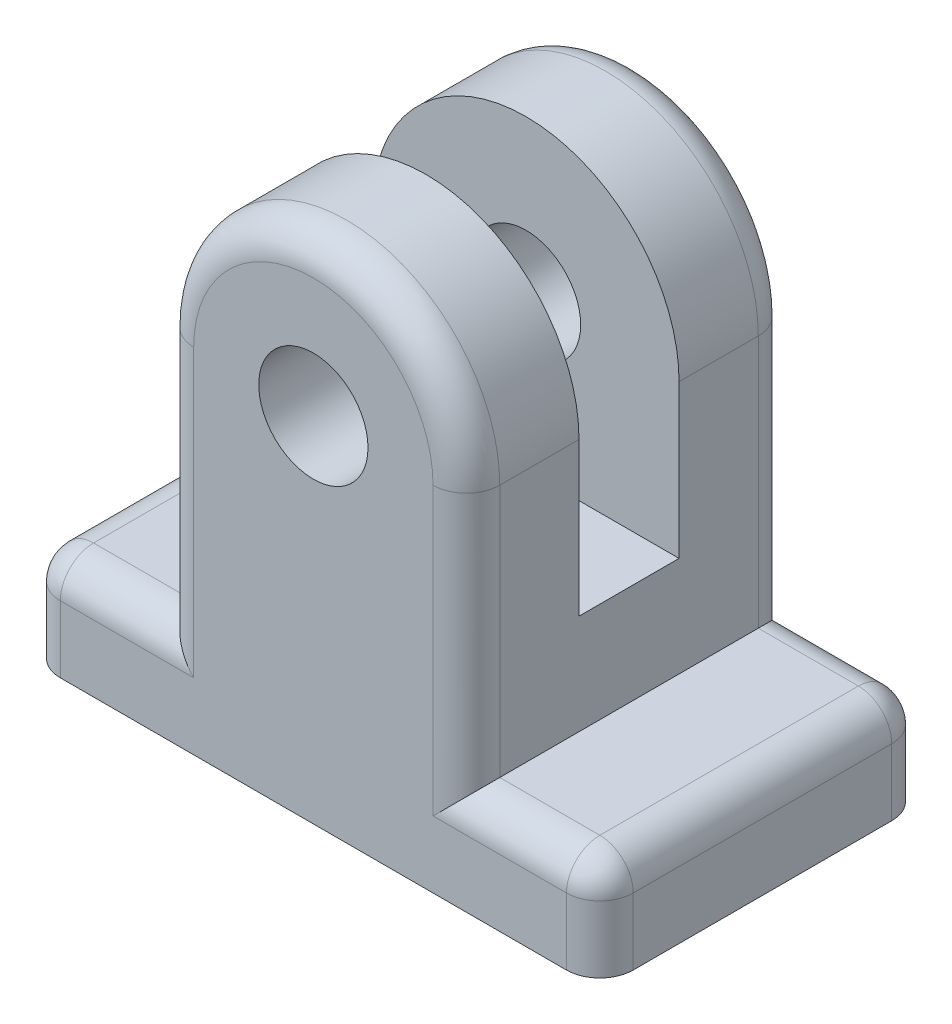
ISO-10303-21;
HEADER;
FILE_DESCRIPTION(('STEP AP214'),'2;1');
FILE_NAME('part.step','',(''),(''),'','','');
FILE_SCHEMA(('AUTOMOTIVE_DESIGN { 1 0 10303 214 1 1 1 1 }'));
ENDSEC;
DATA;
#1=APPLICATION_CONTEXT('core data for automotive mechanical design processes');
#2=APPLICATION_PROTOCOL_DEFINITION('international standard','automotive_design',2000,#1);
#3=PRODUCT_CONTEXT('',#1,'mechanical');
#4=PRODUCT('Part','Part','',(#3));
#5=PRODUCT_RELATED_PRODUCT_CATEGORY('part','',(#4));
#6=PRODUCT_DEFINITION_FORMATION('','',#4);
#7=PRODUCT_DEFINITION_CONTEXT('part definition',#1,'design');
#8=PRODUCT_DEFINITION('design','',#6,#7);
#9=PRODUCT_DEFINITION_SHAPE('','',#8);
#10=(LENGTH_UNIT() NAMED_UNIT(*) SI_UNIT(.MILLI.,.METRE.));
#11=(NAMED_UNIT(*) PLANE_ANGLE_UNIT() SI_UNIT($,.RADIAN.));
#12=(NAMED_UNIT(*) SI_UNIT($,.STERADIAN.) SOLID_ANGLE_UNIT());
#13=UNCERTAINTY_MEASURE_WITH_UNIT(LENGTH_MEASURE(1.E-05),#10,'distance_accuracy_value','');
#14=(GEOMETRIC_REPRESENTATION_CONTEXT(3) GLOBAL_UNCERTAINTY_ASSIGNED_CONTEXT((#13)) GLOBAL_UNIT_ASSIGNED_CONTEXT((#10,
#11,#12)) REPRESENTATION_CONTEXT('',''));
#15=CARTESIAN_POINT('',(0.,0.,0.));
#16=DIRECTION('',(0.,0.,1.));
#17=DIRECTION('',(1.,0.,0.));
#18=AXIS2_PLACEMENT_3D('',#15,#16,#17);
#19=CARTESIAN_POINT('',(0.,0.,4.875));
#20=DIRECTION('',(0.,0.,-1.));
#21=DIRECTION('',(-1.,0.,0.));
#22=AXIS2_PLACEMENT_3D('',#19,#20,#21);
#23=CYLINDRICAL_SURFACE('',#22,4.5875);
#24=DIRECTION('',(0.,0.,-1.));
#25=VECTOR('',#24,1.);
#26=CARTESIAN_POINT('',(4.5875,0.,4.875));
#27=LINE('',#26,#25);
#28=CARTESIAN_POINT('',(4.5875,0.,-1.5));
#29=VERTEX_POINT('',#28);
#30=CARTESIAN_POINT('',(4.5875,0.,-3.875));
#31=VERTEX_POINT('',#30);
#32=EDGE_CURVE('E380',#29,#31,#27,.T.);
#33=ORIENTED_EDGE('',*,*,#32,.T.);
#34=CARTESIAN_POINT('',(0.,0.,-3.875));
#35=DIRECTION('',(0.,0.,1.));
#36=DIRECTION('',(1.,0.,0.));
#37=AXIS2_PLACEMENT_3D('',#34,#35,#36);
#38=CIRCLE('',#37,4.5875);
#39=CARTESIAN_POINT('',(-4.5875,0.,-3.875));
#40=VERTEX_POINT('',#39);
#41=EDGE_CURVE('E207',#31,#40,#38,.T.);
#42=ORIENTED_EDGE('',*,*,#41,.T.);
#43=DIRECTION('',(0.,0.,-1.));
#44=VECTOR('',#43,1.);
#45=CARTESIAN_POINT('',(-4.5875,0.,4.875));
#46=LINE('',#45,#44);
#47=CARTESIAN_POINT('',(-4.5875,0.,-1.5));
#48=VERTEX_POINT('',#47);
#49=EDGE_CURVE('E200',#48,#40,#46,.T.);
#50=ORIENTED_EDGE('',*,*,#49,.F.);
#51=CARTESIAN_POINT('',(0.,0.,-1.5));
#52=DIRECTION('',(0.,0.,1.));
#53=DIRECTION('',(1.,0.,0.));
#54=AXIS2_PLACEMENT_3D('',#51,#52,#53);
#55=CIRCLE('',#54,4.5875);
#56=EDGE_CURVE('E182',#29,#48,#55,.T.);
#57=ORIENTED_EDGE('',*,*,#56,.F.);
#58=EDGE_LOOP('',(#33,#42,#50,#57));
#59=FACE_BOUND('',#58,.T.);
#60=ADVANCED_FACE('F34',(#59),#23,.T.);
#61=CARTESIAN_POINT('',(-4.5875,0.,4.875));
#62=DIRECTION('',(1.,0.,0.));
#63=DIRECTION('',(0.,1.,0.));
#64=AXIS2_PLACEMENT_3D('',#61,#62,#63);
#65=PLANE('',#64);
#66=ORIENTED_EDGE('',*,*,#49,.T.);
#67=DIRECTION('',(0.,-1.,0.));
#68=VECTOR('',#67,1.);
#69=CARTESIAN_POINT('',(-4.5875,0.,-3.875));
#70=LINE('',#69,#68);
#71=CARTESIAN_POINT('',(-4.5875,-7.5875,-3.875));
#72=VERTEX_POINT('',#71);
#73=EDGE_CURVE('E218',#40,#72,#70,.T.);
#74=ORIENTED_EDGE('',*,*,#73,.T.);
#75=DIRECTION('',(0.,0.,-1.));
#76=VECTOR('',#75,1.);
#77=CARTESIAN_POINT('',(-4.5875,-7.5875,4.875));
#78=LINE('',#77,#76);
#79=CARTESIAN_POINT('',(-4.5875,-7.5875,3.875));
#80=VERTEX_POINT('',#79);
#81=EDGE_CURVE('E209',#80,#72,#78,.T.);
#82=ORIENTED_EDGE('',*,*,#81,.F.);
#83=DIRECTION('',(0.,-1.,0.));
#84=VECTOR('',#83,1.);
#85=CARTESIAN_POINT('',(-4.5875,0.,3.875));
#86=LINE('',#85,#84);
#87=CARTESIAN_POINT('',(-4.5875,0.,3.875));
#88=VERTEX_POINT('',#87);
#89=EDGE_CURVE('E211',#80,#88,#86,.F.);
#90=ORIENTED_EDGE('',*,*,#89,.T.);
#91=CARTESIAN_POINT('',(-4.5875,0.,1.5));
#92=VERTEX_POINT('',#91);
#93=EDGE_CURVE('E208',#88,#92,#46,.T.);
#94=ORIENTED_EDGE('',*,*,#93,.T.);
#95=DIRECTION('',(0.,-1.,0.));
#96=VECTOR('',#95,1.);
#97=CARTESIAN_POINT('',(-4.5875,0.,1.5));
#98=LINE('',#97,#96);
#99=CARTESIAN_POINT('',(-4.5875,-4.5875,1.5));
#100=VERTEX_POINT('',#99);
#101=EDGE_CURVE('E360',#92,#100,#98,.T.);
#102=ORIENTED_EDGE('',*,*,#101,.T.);
#103=DIRECTION('',(0.,0.,1.));
#104=VECTOR('',#103,1.);
#105=CARTESIAN_POINT('',(-4.5875,-4.5875,-1.5));
#106=LINE('',#105,#104);
#107=CARTESIAN_POINT('',(-4.5875,-4.5875,-1.5));
#108=VERTEX_POINT('',#107);
#109=EDGE_CURVE('E203',#108,#100,#106,.T.);
#110=ORIENTED_EDGE('',*,*,#109,.F.);
#111=DIRECTION('',(0.,-1.,0.));
#112=VECTOR('',#111,1.);
#113=CARTESIAN_POINT('',(-4.5875,0.,-1.5));
#114=LINE('',#113,#112);
#115=EDGE_CURVE('E186',#48,#108,#114,.T.);
#116=ORIENTED_EDGE('',*,*,#115,.F.);
#117=EDGE_LOOP('',(#66,#74,#82,#90,#94,#102,#110,#116));
#118=FACE_BOUND('',#117,.T.);
#119=ADVANCED_FACE('F198',(#118),#65,.F.);
#120=CARTESIAN_POINT('',(4.5875,0.,4.875));
#121=DIRECTION('',(-1.,0.,0.));
#122=DIRECTION('',(0.,-1.,0.));
#123=AXIS2_PLACEMENT_3D('',#120,#121,#122);
#124=PLANE('',#123);
#125=DIRECTION('',(0.,0.,-1.));
#126=VECTOR('',#125,1.);
#127=CARTESIAN_POINT('',(4.5875,-7.5875,4.875));
#128=LINE('',#127,#126);
#129=CARTESIAN_POINT('',(4.5875,-7.5875,3.875));
#130=VERTEX_POINT('',#129);
#131=CARTESIAN_POINT('',(4.5875,-7.5875,-3.875));
#132=VERTEX_POINT('',#131);
#133=EDGE_CURVE('E385',#130,#132,#128,.T.);
#134=ORIENTED_EDGE('',*,*,#133,.T.);
#135=DIRECTION('',(0.,1.,0.));
#136=VECTOR('',#135,1.);
#137=CARTESIAN_POINT('',(4.5875,0.,-3.875));
#138=LINE('',#137,#136);
#139=EDGE_CURVE('E238',#132,#31,#138,.T.);
#140=ORIENTED_EDGE('',*,*,#139,.T.);
#141=ORIENTED_EDGE('',*,*,#32,.F.);
#142=DIRECTION('',(0.,1.,0.));
#143=VECTOR('',#142,1.);
#144=CARTESIAN_POINT('',(4.5875,-4.5875,-1.5));
#145=LINE('',#144,#143);
#146=CARTESIAN_POINT('',(4.5875,-4.5875,-1.5));
#147=VERTEX_POINT('',#146);
#148=EDGE_CURVE('E189',#147,#29,#145,.T.);
#149=ORIENTED_EDGE('',*,*,#148,.F.);
#150=DIRECTION('',(0.,0.,1.));
#151=VECTOR('',#150,1.);
#152=CARTESIAN_POINT('',(4.5875,-4.5875,-1.5));
#153=LINE('',#152,#151);
#154=CARTESIAN_POINT('',(4.5875,-4.5875,1.5));
#155=VERTEX_POINT('',#154);
#156=EDGE_CURVE('E366',#147,#155,#153,.T.);
#157=ORIENTED_EDGE('',*,*,#156,.T.);
#158=DIRECTION('',(0.,1.,0.));
#159=VECTOR('',#158,1.);
#160=CARTESIAN_POINT('',(4.5875,-4.5875,1.5));
#161=LINE('',#160,#159);
#162=CARTESIAN_POINT('',(4.5875,0.,1.5));
#163=VERTEX_POINT('',#162);
#164=EDGE_CURVE('E194',#155,#163,#161,.T.);
#165=ORIENTED_EDGE('',*,*,#164,.T.);
#166=CARTESIAN_POINT('',(4.5875,0.,3.875));
#167=VERTEX_POINT('',#166);
#168=EDGE_CURVE('E383',#167,#163,#27,.T.);
#169=ORIENTED_EDGE('',*,*,#168,.F.);
#170=DIRECTION('',(0.,1.,0.));
#171=VECTOR('',#170,1.);
#172=CARTESIAN_POINT('',(4.5875,-7.5875,3.875));
#173=LINE('',#172,#171);
#174=EDGE_CURVE('E236',#167,#130,#173,.F.);
#175=ORIENTED_EDGE('',*,*,#174,.T.);
#176=EDGE_LOOP('',(#134,#140,#141,#149,#157,#165,#169,#175));
#177=FACE_BOUND('',#176,.T.);
#178=ADVANCED_FACE('F471',(#177),#124,.F.);
#179=CARTESIAN_POINT('',(0.,0.,4.875));
#180=DIRECTION('',(0.,0.,-1.));
#181=DIRECTION('',(-1.,0.,0.));
#182=AXIS2_PLACEMENT_3D('',#179,#180,#181);
#183=CYLINDRICAL_SURFACE('',#182,1.6375);
#184=CARTESIAN_POINT('',(0.,0.,-4.875));
#185=DIRECTION('',(0.,0.,1.));
#186=DIRECTION('',(1.,0.,0.));
#187=AXIS2_PLACEMENT_3D('',#184,#185,#186);
#188=CIRCLE('',#187,1.6375);
#189=CARTESIAN_POINT('',(1.6375,0.,-4.875));
#190=VERTEX_POINT('',#189);
#191=EDGE_CURVE('E369',#190,#190,#188,.T.);
#192=ORIENTED_EDGE('',*,*,#191,.F.);
#193=EDGE_LOOP('',(#192));
#194=FACE_BOUND('',#193,.T.);
#195=CARTESIAN_POINT('',(0.,0.,-1.5));
#196=DIRECTION('',(0.,0.,1.));
#197=DIRECTION('',(1.,0.,0.));
#198=AXIS2_PLACEMENT_3D('',#195,#196,#197);
#199=CIRCLE('',#198,1.6375);
#200=CARTESIAN_POINT('',(1.6375,0.,-1.5));
#201=VERTEX_POINT('',#200);
#202=EDGE_CURVE('E348',#201,#201,#199,.T.);
#203=ORIENTED_EDGE('',*,*,#202,.T.);
#204=EDGE_LOOP('',(#203));
#205=FACE_BOUND('',#204,.T.);
#206=ADVANCED_FACE('F528',(#194,#205),#183,.F.);
#207=CARTESIAN_POINT('',(0.,0.,4.875));
#208=DIRECTION('',(0.,0.,1.));
#209=DIRECTION('',(1.,0.,0.));
#210=AXIS2_PLACEMENT_3D('',#207,#208,#209);
#211=PLANE('',#210);
#212=DIRECTION('',(-1.,0.,0.));
#213=VECTOR('',#212,1.);
#214=CARTESIAN_POINT('',(-8.5875,-8.5875,4.875));
#215=LINE('',#214,#213);
#216=CARTESIAN_POINT('',(-3.5875,-8.5875,4.875));
#217=VERTEX_POINT('',#216);
#218=CARTESIAN_POINT('',(-7.5875,-8.5875,4.875));
#219=VERTEX_POINT('',#218);
#220=EDGE_CURVE('E250',#217,#219,#215,.T.);
#221=ORIENTED_EDGE('',*,*,#220,.T.);
#222=DIRECTION('',(0.,-1.,0.));
#223=VECTOR('',#222,1.);
#224=CARTESIAN_POINT('',(-7.5875,-10.5875,4.875));
#225=LINE('',#224,#223);
#226=CARTESIAN_POINT('',(-7.5875,-10.5875,4.875));
#227=VERTEX_POINT('',#226);
#228=EDGE_CURVE('E252',#219,#227,#225,.T.);
#229=ORIENTED_EDGE('',*,*,#228,.T.);
#230=DIRECTION('',(1.,0.,0.));
#231=VECTOR('',#230,1.);
#232=CARTESIAN_POINT('',(-8.5875,-10.5875,4.875));
#233=LINE('',#232,#231);
#234=CARTESIAN_POINT('',(7.5875,-10.5875,4.875));
#235=VERTEX_POINT('',#234);
#236=EDGE_CURVE('E377',#227,#235,#233,.T.);
#237=ORIENTED_EDGE('',*,*,#236,.T.);
#238=DIRECTION('',(0.,1.,0.));
#239=VECTOR('',#238,1.);
#240=CARTESIAN_POINT('',(7.5875,-7.5875,4.875));
#241=LINE('',#240,#239);
#242=CARTESIAN_POINT('',(7.5875,-8.5875,4.875));
#243=VERTEX_POINT('',#242);
#244=EDGE_CURVE('E242',#235,#243,#241,.T.);
#245=ORIENTED_EDGE('',*,*,#244,.T.);
#246=DIRECTION('',(-1.,0.,0.));
#247=VECTOR('',#246,1.);
#248=CARTESIAN_POINT('',(4.5875,-8.5875,4.875));
#249=LINE('',#248,#247);
#250=CARTESIAN_POINT('',(3.5875,-8.5875,4.875));
#251=VERTEX_POINT('',#250);
#252=EDGE_CURVE('E240',#243,#251,#249,.T.);
#253=ORIENTED_EDGE('',*,*,#252,.T.);
#254=DIRECTION('',(0.,1.,0.));
#255=VECTOR('',#254,1.);
#256=CARTESIAN_POINT('',(3.5875,0.,4.875));
#257=LINE('',#256,#255);
#258=CARTESIAN_POINT('',(3.5875,0.,4.875));
#259=VERTEX_POINT('',#258);
#260=EDGE_CURVE('E244',#251,#259,#257,.T.);
#261=ORIENTED_EDGE('',*,*,#260,.T.);
#262=CARTESIAN_POINT('',(0.,0.,4.875));
#263=DIRECTION('',(0.,0.,1.));
#264=DIRECTION('',(1.,0.,0.));
#265=AXIS2_PLACEMENT_3D('',#262,#263,#264);
#266=CIRCLE('',#265,3.5875);
#267=CARTESIAN_POINT('',(-3.5875,0.,4.875));
#268=VERTEX_POINT('',#267);
#269=EDGE_CURVE('E246',#259,#268,#266,.T.);
#270=ORIENTED_EDGE('',*,*,#269,.T.);
#271=DIRECTION('',(0.,-1.,0.));
#272=VECTOR('',#271,1.);
#273=CARTESIAN_POINT('',(-3.5875,-7.5875,4.875));
#274=LINE('',#273,#272);
#275=EDGE_CURVE('E248',#268,#217,#274,.T.);
#276=ORIENTED_EDGE('',*,*,#275,.T.);
#277=EDGE_LOOP('',(#221,#229,#237,#245,#253,#261,#270,#276));
#278=FACE_BOUND('',#277,.T.);
#279=CARTESIAN_POINT('',(0.,0.,4.875));
#280=DIRECTION('',(0.,0.,1.));
#281=DIRECTION('',(1.,0.,0.));
#282=AXIS2_PLACEMENT_3D('',#279,#280,#281);
#283=CIRCLE('',#282,1.6375);
#284=CARTESIAN_POINT('',(1.6375,0.,4.875));
#285=VERTEX_POINT('',#284);
#286=EDGE_CURVE('E371',#285,#285,#283,.T.);
#287=ORIENTED_EDGE('',*,*,#286,.F.);
#288=EDGE_LOOP('',(#287));
#289=FACE_BOUND('',#288,.T.);
#290=ADVANCED_FACE('F436',(#278,#289),#211,.T.);
#291=CARTESIAN_POINT('',(0.,0.,-4.875));
#292=DIRECTION('',(0.,0.,1.));
#293=DIRECTION('',(1.,0.,0.));
#294=AXIS2_PLACEMENT_3D('',#291,#292,#293);
#295=PLANE('',#294);
#296=DIRECTION('',(1.,0.,0.));
#297=VECTOR('',#296,1.);
#298=CARTESIAN_POINT('',(-8.5875,-10.5875,-4.875));
#299=LINE('',#298,#297);
#300=CARTESIAN_POINT('',(-7.5875,-10.5875,-4.875));
#301=VERTEX_POINT('',#300);
#302=CARTESIAN_POINT('',(7.5875,-10.5875,-4.875));
#303=VERTEX_POINT('',#302);
#304=EDGE_CURVE('E374',#301,#303,#299,.T.);
#305=ORIENTED_EDGE('',*,*,#304,.F.);
#306=DIRECTION('',(0.,-1.,0.));
#307=VECTOR('',#306,1.);
#308=CARTESIAN_POINT('',(-7.5875,0.,-4.875));
#309=LINE('',#308,#307);
#310=CARTESIAN_POINT('',(-7.5875,-8.5875,-4.875));
#311=VERTEX_POINT('',#310);
#312=EDGE_CURVE('E233',#301,#311,#309,.F.);
#313=ORIENTED_EDGE('',*,*,#312,.T.);
#314=DIRECTION('',(-1.,0.,0.));
#315=VECTOR('',#314,1.);
#316=CARTESIAN_POINT('',(0.,-8.5875,-4.875));
#317=LINE('',#316,#315);
#318=CARTESIAN_POINT('',(-3.5875,-8.5875,-4.875));
#319=VERTEX_POINT('',#318);
#320=EDGE_CURVE('E231',#311,#319,#317,.F.);
#321=ORIENTED_EDGE('',*,*,#320,.T.);
#322=DIRECTION('',(0.,-1.,0.));
#323=VECTOR('',#322,1.);
#324=CARTESIAN_POINT('',(-3.5875,0.,-4.875));
#325=LINE('',#324,#323);
#326=CARTESIAN_POINT('',(-3.5875,0.,-4.875));
#327=VERTEX_POINT('',#326);
#328=EDGE_CURVE('E228',#319,#327,#325,.F.);
#329=ORIENTED_EDGE('',*,*,#328,.T.);
#330=CARTESIAN_POINT('',(0.,0.,-4.875));
#331=DIRECTION('',(0.,0.,1.));
#332=DIRECTION('',(1.,0.,0.));
#333=AXIS2_PLACEMENT_3D('',#330,#331,#332);
#334=CIRCLE('',#333,3.5875);
#335=CARTESIAN_POINT('',(3.5875,0.,-4.875));
#336=VERTEX_POINT('',#335);
#337=EDGE_CURVE('E226',#327,#336,#334,.F.);
#338=ORIENTED_EDGE('',*,*,#337,.T.);
#339=DIRECTION('',(0.,1.,0.));
#340=VECTOR('',#339,1.);
#341=CARTESIAN_POINT('',(3.5875,0.,-4.875));
#342=LINE('',#341,#340);
#343=CARTESIAN_POINT('',(3.5875,-8.5875,-4.875));
#344=VERTEX_POINT('',#343);
#345=EDGE_CURVE('E224',#336,#344,#342,.F.);
#346=ORIENTED_EDGE('',*,*,#345,.T.);
#347=DIRECTION('',(-1.,0.,0.));
#348=VECTOR('',#347,1.);
#349=CARTESIAN_POINT('',(0.,-8.5875,-4.875));
#350=LINE('',#349,#348);
#351=CARTESIAN_POINT('',(7.5875,-8.5875,-4.875));
#352=VERTEX_POINT('',#351);
#353=EDGE_CURVE('E222',#344,#352,#350,.F.);
#354=ORIENTED_EDGE('',*,*,#353,.T.);
#355=DIRECTION('',(0.,1.,0.));
#356=VECTOR('',#355,1.);
#357=CARTESIAN_POINT('',(7.5875,0.,-4.875));
#358=LINE('',#357,#356);
#359=EDGE_CURVE('E220',#352,#303,#358,.F.);
#360=ORIENTED_EDGE('',*,*,#359,.T.);
#361=EDGE_LOOP('',(#305,#313,#321,#329,#338,#346,#354,#360));
#362=FACE_BOUND('',#361,.T.);
#363=ORIENTED_EDGE('',*,*,#191,.T.);
#364=EDGE_LOOP('',(#363));
#365=FACE_BOUND('',#364,.T.);
#366=ADVANCED_FACE('F407',(#362,#365),#295,.F.);
#367=ORIENTED_EDGE('',*,*,#93,.F.);
#368=CARTESIAN_POINT('',(0.,0.,3.875));
#369=DIRECTION('',(0.,0.,1.));
#370=DIRECTION('',(1.,0.,0.));
#371=AXIS2_PLACEMENT_3D('',#368,#369,#370);
#372=CIRCLE('',#371,4.5875);
#373=EDGE_CURVE('E254',#88,#167,#372,.F.);
#374=ORIENTED_EDGE('',*,*,#373,.T.);
#375=ORIENTED_EDGE('',*,*,#168,.T.);
#376=CARTESIAN_POINT('',(0.,0.,1.5));
#377=DIRECTION('',(0.,0.,1.));
#378=DIRECTION('',(1.,0.,0.));
#379=AXIS2_PLACEMENT_3D('',#376,#377,#378);
#380=CIRCLE('',#379,4.5875);
#381=EDGE_CURVE('E353',#163,#92,#380,.T.);
#382=ORIENTED_EDGE('',*,*,#381,.T.);
#383=EDGE_LOOP('',(#367,#374,#375,#382));
#384=FACE_BOUND('',#383,.T.);
#385=ADVANCED_FACE('F463',(#384),#23,.T.);
#386=CARTESIAN_POINT('',(-4.5875,-7.5875,4.875));
#387=DIRECTION('',(0.,-1.,0.));
#388=DIRECTION('',(0.,0.,-1.));
#389=AXIS2_PLACEMENT_3D('',#386,#387,#388);
#390=PLANE('',#389);
#391=ORIENTED_EDGE('',*,*,#81,.T.);
#392=DIRECTION('',(-1.,0.,0.));
#393=VECTOR('',#392,1.);
#394=CARTESIAN_POINT('',(-4.5875,-7.5875,-3.875));
#395=LINE('',#394,#393);
#396=CARTESIAN_POINT('',(-7.5875,-7.5875,-3.875));
#397=VERTEX_POINT('',#396);
#398=EDGE_CURVE('E274',#72,#397,#395,.T.);
#399=ORIENTED_EDGE('',*,*,#398,.T.);
#400=DIRECTION('',(0.,0.,-1.));
#401=VECTOR('',#400,1.);
#402=CARTESIAN_POINT('',(-7.5875,-7.5875,4.875));
#403=LINE('',#402,#401);
#404=CARTESIAN_POINT('',(-7.5875,-7.5875,3.875));
#405=VERTEX_POINT('',#404);
#406=EDGE_CURVE('E272',#397,#405,#403,.F.);
#407=ORIENTED_EDGE('',*,*,#406,.T.);
#408=DIRECTION('',(-1.,0.,0.));
#409=VECTOR('',#408,1.);
#410=CARTESIAN_POINT('',(-4.5875,-7.5875,3.875));
#411=LINE('',#410,#409);
#412=EDGE_CURVE('E270',#405,#80,#411,.F.);
#413=ORIENTED_EDGE('',*,*,#412,.T.);
#414=EDGE_LOOP('',(#391,#399,#407,#413));
#415=FACE_BOUND('',#414,.T.);
#416=ADVANCED_FACE('F456',(#415),#390,.F.);
#417=CARTESIAN_POINT('',(-8.5875,-7.5875,4.875));
#418=DIRECTION('',(1.,0.,0.));
#419=DIRECTION('',(0.,0.,-1.));
#420=AXIS2_PLACEMENT_3D('',#417,#418,#419);
#421=PLANE('',#420);
#422=DIRECTION('',(0.,0.,-1.));
#423=VECTOR('',#422,1.);
#424=CARTESIAN_POINT('',(-8.5875,-8.5875,4.875));
#425=LINE('',#424,#423);
#426=CARTESIAN_POINT('',(-8.5875,-8.5875,3.875));
#427=VERTEX_POINT('',#426);
#428=CARTESIAN_POINT('',(-8.5875,-8.5875,-3.875));
#429=VERTEX_POINT('',#428);
#430=EDGE_CURVE('E258',#427,#429,#425,.T.);
#431=ORIENTED_EDGE('',*,*,#430,.T.);
#432=DIRECTION('',(0.,-1.,0.));
#433=VECTOR('',#432,1.);
#434=CARTESIAN_POINT('',(-8.5875,-7.5875,-3.875));
#435=LINE('',#434,#433);
#436=CARTESIAN_POINT('',(-8.5875,-10.5875,-3.875));
#437=VERTEX_POINT('',#436);
#438=EDGE_CURVE('E260',#429,#437,#435,.T.);
#439=ORIENTED_EDGE('',*,*,#438,.T.);
#440=DIRECTION('',(0.,0.,-1.));
#441=VECTOR('',#440,1.);
#442=CARTESIAN_POINT('',(-8.5875,-10.5875,4.875));
#443=LINE('',#442,#441);
#444=CARTESIAN_POINT('',(-8.5875,-10.5875,3.875));
#445=VERTEX_POINT('',#444);
#446=EDGE_CURVE('E213',#445,#437,#443,.T.);
#447=ORIENTED_EDGE('',*,*,#446,.F.);
#448=DIRECTION('',(0.,-1.,0.));
#449=VECTOR('',#448,1.);
#450=CARTESIAN_POINT('',(-8.5875,-7.5875,3.875));
#451=LINE('',#450,#449);
#452=EDGE_CURVE('E256',#445,#427,#451,.F.);
#453=ORIENTED_EDGE('',*,*,#452,.T.);
#454=EDGE_LOOP('',(#431,#439,#447,#453));
#455=FACE_BOUND('',#454,.T.);
#456=ADVANCED_FACE('F454',(#455),#421,.F.);
#457=CARTESIAN_POINT('',(-8.5875,-10.5875,4.875));
#458=DIRECTION('',(0.,1.,0.));
#459=DIRECTION('',(0.,0.,1.));
#460=AXIS2_PLACEMENT_3D('',#457,#458,#459);
#461=PLANE('',#460);
#462=ORIENTED_EDGE('',*,*,#446,.T.);
#463=CARTESIAN_POINT('',(-7.5875,-10.5875,-3.875));
#464=DIRECTION('',(0.,1.,0.));
#465=DIRECTION('',(0.,0.,1.));
#466=AXIS2_PLACEMENT_3D('',#463,#464,#465);
#467=CIRCLE('',#466,1.);
#468=EDGE_CURVE('E268',#437,#301,#467,.F.);
#469=ORIENTED_EDGE('',*,*,#468,.T.);
#470=ORIENTED_EDGE('',*,*,#304,.T.);
#471=CARTESIAN_POINT('',(7.5875,-10.5875,-3.875));
#472=DIRECTION('',(0.,1.,0.));
#473=DIRECTION('',(0.,0.,1.));
#474=AXIS2_PLACEMENT_3D('',#471,#472,#473);
#475=CIRCLE('',#474,1.);
#476=CARTESIAN_POINT('',(8.5875,-10.5875,-3.875));
#477=VERTEX_POINT('',#476);
#478=EDGE_CURVE('E264',#303,#477,#475,.F.);
#479=ORIENTED_EDGE('',*,*,#478,.T.);
#480=DIRECTION('',(0.,0.,-1.));
#481=VECTOR('',#480,1.);
#482=CARTESIAN_POINT('',(8.5875,-10.5875,4.875));
#483=LINE('',#482,#481);
#484=CARTESIAN_POINT('',(8.5875,-10.5875,3.875));
#485=VERTEX_POINT('',#484);
#486=EDGE_CURVE('E388',#485,#477,#483,.T.);
#487=ORIENTED_EDGE('',*,*,#486,.F.);
#488=CARTESIAN_POINT('',(7.5875,-10.5875,3.875));
#489=DIRECTION('',(0.,1.,0.));
#490=DIRECTION('',(0.,0.,1.));
#491=AXIS2_PLACEMENT_3D('',#488,#489,#490);
#492=CIRCLE('',#491,1.);
#493=EDGE_CURVE('E262',#485,#235,#492,.F.);
#494=ORIENTED_EDGE('',*,*,#493,.T.);
#495=ORIENTED_EDGE('',*,*,#236,.F.);
#496=CARTESIAN_POINT('',(-7.5875,-10.5875,3.875));
#497=DIRECTION('',(0.,1.,0.));
#498=DIRECTION('',(0.,0.,1.));
#499=AXIS2_PLACEMENT_3D('',#496,#497,#498);
#500=CIRCLE('',#499,1.);
#501=EDGE_CURVE('E266',#227,#445,#500,.F.);
#502=ORIENTED_EDGE('',*,*,#501,.T.);
#503=EDGE_LOOP('',(#462,#469,#470,#479,#487,#494,#495,#502));
#504=FACE_BOUND('',#503,.T.);
#505=ADVANCED_FACE('F393',(#504),#461,.F.);
#506=CARTESIAN_POINT('',(8.5875,-7.5875,4.875));
#507=DIRECTION('',(-1.,0.,0.));
#508=DIRECTION('',(0.,0.,1.));
#509=AXIS2_PLACEMENT_3D('',#506,#507,#508);
#510=PLANE('',#509);
#511=ORIENTED_EDGE('',*,*,#486,.T.);
#512=DIRECTION('',(0.,1.,0.));
#513=VECTOR('',#512,1.);
#514=CARTESIAN_POINT('',(8.5875,-7.5875,-3.875));
#515=LINE('',#514,#513);
#516=CARTESIAN_POINT('',(8.5875,-8.5875,-3.875));
#517=VERTEX_POINT('',#516);
#518=EDGE_CURVE('E11',#477,#517,#515,.T.);
#519=ORIENTED_EDGE('',*,*,#518,.T.);
#520=DIRECTION('',(0.,0.,-1.));
#521=VECTOR('',#520,1.);
#522=CARTESIAN_POINT('',(8.5875,-8.5875,4.875));
#523=LINE('',#522,#521);
#524=CARTESIAN_POINT('',(8.5875,-8.5875,3.875));
#525=VERTEX_POINT('',#524);
#526=EDGE_CURVE('E50',#517,#525,#523,.F.);
#527=ORIENTED_EDGE('',*,*,#526,.T.);
#528=DIRECTION('',(0.,1.,0.));
#529=VECTOR('',#528,1.);
#530=CARTESIAN_POINT('',(8.5875,-10.5875,3.875));
#531=LINE('',#530,#529);
#532=EDGE_CURVE('E43',#525,#485,#531,.F.);
#533=ORIENTED_EDGE('',*,*,#532,.T.);
#534=EDGE_LOOP('',(#511,#519,#527,#533));
#535=FACE_BOUND('',#534,.T.);
#536=ADVANCED_FACE('F434',(#535),#510,.F.);
#537=CARTESIAN_POINT('',(4.5875,-7.5875,4.875));
#538=DIRECTION('',(0.,-1.,0.));
#539=DIRECTION('',(0.,0.,-1.));
#540=AXIS2_PLACEMENT_3D('',#537,#538,#539);
#541=PLANE('',#540);
#542=DIRECTION('',(0.,0.,-1.));
#543=VECTOR('',#542,1.);
#544=CARTESIAN_POINT('',(7.5875,-7.5875,4.875));
#545=LINE('',#544,#543);
#546=CARTESIAN_POINT('',(7.5875,-7.5875,3.875));
#547=VERTEX_POINT('',#546);
#548=CARTESIAN_POINT('',(7.5875,-7.5875,-3.875));
#549=VERTEX_POINT('',#548);
#550=EDGE_CURVE('E278',#547,#549,#545,.T.);
#551=ORIENTED_EDGE('',*,*,#550,.T.);
#552=DIRECTION('',(-1.,0.,0.));
#553=VECTOR('',#552,1.);
#554=CARTESIAN_POINT('',(4.5875,-7.5875,-3.875));
#555=LINE('',#554,#553);
#556=EDGE_CURVE('E280',#549,#132,#555,.T.);
#557=ORIENTED_EDGE('',*,*,#556,.T.);
#558=ORIENTED_EDGE('',*,*,#133,.F.);
#559=DIRECTION('',(-1.,0.,0.));
#560=VECTOR('',#559,1.);
#561=CARTESIAN_POINT('',(8.5875,-7.5875,3.875));
#562=LINE('',#561,#560);
#563=EDGE_CURVE('E276',#130,#547,#562,.F.);
#564=ORIENTED_EDGE('',*,*,#563,.T.);
#565=EDGE_LOOP('',(#551,#557,#558,#564));
#566=FACE_BOUND('',#565,.T.);
#567=ADVANCED_FACE('F498',(#566),#541,.F.);
#568=CARTESIAN_POINT('',(0.,0.,1.5));
#569=DIRECTION('',(0.,0.,1.));
#570=DIRECTION('',(1.,0.,0.));
#571=AXIS2_PLACEMENT_3D('',#568,#569,#570);
#572=CIRCLE('',#571,1.6375);
#573=CARTESIAN_POINT('',(1.6375,0.,1.5));
#574=VERTEX_POINT('',#573);
#575=EDGE_CURVE('E342',#574,#574,#572,.T.);
#576=ORIENTED_EDGE('',*,*,#575,.F.);
#577=EDGE_LOOP('',(#576));
#578=FACE_BOUND('',#577,.T.);
#579=ORIENTED_EDGE('',*,*,#286,.T.);
#580=EDGE_LOOP('',(#579));
#581=FACE_BOUND('',#580,.T.);
#582=ADVANCED_FACE('F524',(#578,#581),#183,.F.);
#583=CARTESIAN_POINT('',(-4.5875,-4.5875,-1.5));
#584=DIRECTION('',(0.,-1.,0.));
#585=DIRECTION('',(0.,0.,-1.));
#586=AXIS2_PLACEMENT_3D('',#583,#584,#585);
#587=PLANE('',#586);
#588=DIRECTION('',(1.,0.,0.));
#589=VECTOR('',#588,1.);
#590=CARTESIAN_POINT('',(-4.5875,-4.5875,1.5));
#591=LINE('',#590,#589);
#592=EDGE_CURVE('E362',#100,#155,#591,.T.);
#593=ORIENTED_EDGE('',*,*,#592,.T.);
#594=ORIENTED_EDGE('',*,*,#156,.F.);
#595=DIRECTION('',(1.,0.,0.));
#596=VECTOR('',#595,1.);
#597=CARTESIAN_POINT('',(-4.5875,-4.5875,-1.5));
#598=LINE('',#597,#596);
#599=EDGE_CURVE('E204',#108,#147,#598,.T.);
#600=ORIENTED_EDGE('',*,*,#599,.F.);
#601=ORIENTED_EDGE('',*,*,#109,.T.);
#602=EDGE_LOOP('',(#593,#594,#600,#601));
#603=FACE_BOUND('',#602,.T.);
#604=ADVANCED_FACE('F509',(#603),#587,.F.);
#605=CARTESIAN_POINT('',(0.,0.,-1.5));
#606=DIRECTION('',(0.,0.,1.));
#607=DIRECTION('',(1.,0.,0.));
#608=AXIS2_PLACEMENT_3D('',#605,#606,#607);
#609=PLANE('',#608);
#610=ORIENTED_EDGE('',*,*,#202,.F.);
#611=EDGE_LOOP('',(#610));
#612=FACE_BOUND('',#611,.T.);
#613=ORIENTED_EDGE('',*,*,#56,.T.);
#614=ORIENTED_EDGE('',*,*,#115,.T.);
#615=ORIENTED_EDGE('',*,*,#599,.T.);
#616=ORIENTED_EDGE('',*,*,#148,.T.);
#617=EDGE_LOOP('',(#613,#614,#615,#616));
#618=FACE_BOUND('',#617,.T.);
#619=ADVANCED_FACE('F184',(#612,#618),#609,.T.);
#620=CARTESIAN_POINT('',(0.,0.,1.5));
#621=DIRECTION('',(0.,0.,1.));
#622=DIRECTION('',(1.,0.,0.));
#623=AXIS2_PLACEMENT_3D('',#620,#621,#622);
#624=PLANE('',#623);
#625=ORIENTED_EDGE('',*,*,#575,.T.);
#626=EDGE_LOOP('',(#625));
#627=FACE_BOUND('',#626,.T.);
#628=ORIENTED_EDGE('',*,*,#381,.F.);
#629=ORIENTED_EDGE('',*,*,#164,.F.);
#630=ORIENTED_EDGE('',*,*,#592,.F.);
#631=ORIENTED_EDGE('',*,*,#101,.F.);
#632=EDGE_LOOP('',(#628,#629,#630,#631));
#633=FACE_BOUND('',#632,.T.);
#634=ADVANCED_FACE('F512',(#627,#633),#624,.F.);
#635=CARTESIAN_POINT('',(3.5875,0.,3.875));
#636=DIRECTION('',(0.,-1.,0.));
#637=DIRECTION('',(1.,0.,0.));
#638=AXIS2_PLACEMENT_3D('',#635,#636,#637);
#639=CYLINDRICAL_SURFACE('',#638,1.);
#640=CARTESIAN_POINT('',(3.5875,0.,3.875));
#641=DIRECTION('',(0.,1.,0.));
#642=DIRECTION('',(-1.,0.,0.));
#643=AXIS2_PLACEMENT_3D('',#640,#641,#642);
#644=CIRCLE('',#643,1.);
#645=EDGE_CURVE('E335',#259,#167,#644,.T.);
#646=ORIENTED_EDGE('',*,*,#645,.F.);
#647=ORIENTED_EDGE('',*,*,#260,.F.);
#648=CARTESIAN_POINT('',(3.5875,-8.5875,3.875));
#649=DIRECTION('',(0.707106781186547,-0.707106781186548,0.));
#650=DIRECTION('',(-0.707106781186548,-0.707106781186547,0.));
#651=AXIS2_PLACEMENT_3D('',#648,#649,#650);
#652=ELLIPSE('',#651,1.4142135623731,1.);
#653=EDGE_CURVE('E38',#130,#251,#652,.T.);
#654=ORIENTED_EDGE('',*,*,#653,.F.);
#655=ORIENTED_EDGE('',*,*,#174,.F.);
#656=EDGE_LOOP('',(#646,#647,#654,#655));
#657=FACE_BOUND('',#656,.T.);
#658=ADVANCED_FACE('F36',(#657),#639,.T.);
#659=CARTESIAN_POINT('',(7.5875,0.,3.875));
#660=DIRECTION('',(0.,-1.,0.));
#661=DIRECTION('',(0.,0.,-1.));
#662=AXIS2_PLACEMENT_3D('',#659,#660,#661);
#663=CYLINDRICAL_SURFACE('',#662,1.);
#664=ORIENTED_EDGE('',*,*,#493,.F.);
#665=ORIENTED_EDGE('',*,*,#532,.F.);
#666=CARTESIAN_POINT('',(7.5875,-8.5875,3.875));
#667=DIRECTION('',(0.,1.,0.));
#668=DIRECTION('',(0.,0.,1.));
#669=AXIS2_PLACEMENT_3D('',#666,#667,#668);
#670=CIRCLE('',#669,1.);
#671=EDGE_CURVE('E333',#243,#525,#670,.T.);
#672=ORIENTED_EDGE('',*,*,#671,.F.);
#673=ORIENTED_EDGE('',*,*,#244,.F.);
#674=EDGE_LOOP('',(#664,#665,#672,#673));
#675=FACE_BOUND('',#674,.T.);
#676=ADVANCED_FACE('F433',(#675),#663,.T.);
#677=CARTESIAN_POINT('',(0.,-8.5875,3.875));
#678=DIRECTION('',(1.,0.,0.));
#679=DIRECTION('',(0.,0.,-1.));
#680=AXIS2_PLACEMENT_3D('',#677,#678,#679);
#681=CYLINDRICAL_SURFACE('',#680,1.);
#682=ORIENTED_EDGE('',*,*,#653,.T.);
#683=ORIENTED_EDGE('',*,*,#252,.F.);
#684=CARTESIAN_POINT('',(7.5875,-8.5875,3.875));
#685=DIRECTION('',(1.,0.,0.));
#686=DIRECTION('',(0.,0.,-1.));
#687=AXIS2_PLACEMENT_3D('',#684,#685,#686);
#688=CIRCLE('',#687,1.);
#689=EDGE_CURVE('E330',#547,#243,#688,.T.);
#690=ORIENTED_EDGE('',*,*,#689,.F.);
#691=ORIENTED_EDGE('',*,*,#563,.F.);
#692=EDGE_LOOP('',(#682,#683,#690,#691));
#693=FACE_BOUND('',#692,.T.);
#694=ADVANCED_FACE('F640',(#693),#681,.T.);
#695=CARTESIAN_POINT('',(0.,0.,3.875));
#696=DIRECTION('',(0.,0.,1.));
#697=DIRECTION('',(1.,0.,0.));
#698=AXIS2_PLACEMENT_3D('',#695,#696,#697);
#699=TOROIDAL_SURFACE('',#698,3.5875,1.);
#700=ORIENTED_EDGE('',*,*,#645,.T.);
#701=ORIENTED_EDGE('',*,*,#373,.F.);
#702=CARTESIAN_POINT('',(-3.5875,0.,3.875));
#703=DIRECTION('',(0.,-1.,0.));
#704=DIRECTION('',(1.,0.,0.));
#705=AXIS2_PLACEMENT_3D('',#702,#703,#704);
#706=CIRCLE('',#705,1.);
#707=EDGE_CURVE('E327',#268,#88,#706,.T.);
#708=ORIENTED_EDGE('',*,*,#707,.F.);
#709=ORIENTED_EDGE('',*,*,#269,.F.);
#710=EDGE_LOOP('',(#700,#701,#708,#709));
#711=FACE_BOUND('',#710,.T.);
#712=ADVANCED_FACE('F485',(#711),#699,.T.);
#713=CARTESIAN_POINT('',(7.5875,-8.5875,3.875));
#714=DIRECTION('',(0.,0.,1.));
#715=DIRECTION('',(1.,0.,0.));
#716=AXIS2_PLACEMENT_3D('',#713,#714,#715);
#717=SPHERICAL_SURFACE('',#716,1.);
#718=ORIENTED_EDGE('',*,*,#689,.T.);
#719=ORIENTED_EDGE('',*,*,#671,.T.);
#720=CARTESIAN_POINT('',(7.5875,-8.5875,3.875));
#721=DIRECTION('',(0.,0.,1.));
#722=DIRECTION('',(1.,0.,0.));
#723=AXIS2_PLACEMENT_3D('',#720,#721,#722);
#724=CIRCLE('',#723,1.);
#725=EDGE_CURVE('E324',#547,#525,#724,.F.);
#726=ORIENTED_EDGE('',*,*,#725,.F.);
#727=EDGE_LOOP('',(#718,#719,#726));
#728=FACE_BOUND('',#727,.T.);
#729=ADVANCED_FACE('F427',(#728),#717,.T.);
#730=CARTESIAN_POINT('',(-3.5875,0.,3.875));
#731=DIRECTION('',(0.,1.,0.));
#732=DIRECTION('',(-1.,0.,0.));
#733=AXIS2_PLACEMENT_3D('',#730,#731,#732);
#734=CYLINDRICAL_SURFACE('',#733,1.);
#735=ORIENTED_EDGE('',*,*,#707,.T.);
#736=ORIENTED_EDGE('',*,*,#89,.F.);
#737=CARTESIAN_POINT('',(-3.5875,-8.5875,3.875));
#738=DIRECTION('',(0.707106781186547,0.707106781186548,0.));
#739=DIRECTION('',(-0.707106781186548,0.707106781186547,0.));
#740=AXIS2_PLACEMENT_3D('',#737,#738,#739);
#741=ELLIPSE('',#740,1.4142135623731,1.);
#742=EDGE_CURVE('E321',#217,#80,#741,.F.);
#743=ORIENTED_EDGE('',*,*,#742,.F.);
#744=ORIENTED_EDGE('',*,*,#275,.F.);
#745=EDGE_LOOP('',(#735,#736,#743,#744));
#746=FACE_BOUND('',#745,.T.);
#747=ADVANCED_FACE('F489',(#746),#734,.T.);
#748=CARTESIAN_POINT('',(7.5875,-7.5875,-3.875));
#749=DIRECTION('',(0.,1.,0.));
#750=DIRECTION('',(0.,0.,1.));
#751=AXIS2_PLACEMENT_3D('',#748,#749,#750);
#752=CYLINDRICAL_SURFACE('',#751,1.);
#753=ORIENTED_EDGE('',*,*,#478,.F.);
#754=ORIENTED_EDGE('',*,*,#359,.F.);
#755=CARTESIAN_POINT('',(7.5875,-8.5875,-3.875));
#756=DIRECTION('',(0.,1.,0.));
#757=DIRECTION('',(0.,0.,1.));
#758=AXIS2_PLACEMENT_3D('',#755,#756,#757);
#759=CIRCLE('',#758,1.);
#760=EDGE_CURVE('E318',#517,#352,#759,.T.);
#761=ORIENTED_EDGE('',*,*,#760,.F.);
#762=ORIENTED_EDGE('',*,*,#518,.F.);
#763=EDGE_LOOP('',(#753,#754,#761,#762));
#764=FACE_BOUND('',#763,.T.);
#765=ADVANCED_FACE('F415',(#764),#752,.T.);
#766=CARTESIAN_POINT('',(7.5875,-8.5875,4.875));
#767=DIRECTION('',(0.,0.,-1.));
#768=DIRECTION('',(-1.,0.,0.));
#769=AXIS2_PLACEMENT_3D('',#766,#767,#768);
#770=CYLINDRICAL_SURFACE('',#769,1.);
#771=ORIENTED_EDGE('',*,*,#725,.T.);
#772=ORIENTED_EDGE('',*,*,#526,.F.);
#773=CARTESIAN_POINT('',(7.5875,-8.5875,-3.875));
#774=DIRECTION('',(0.,0.,-1.));
#775=DIRECTION('',(-1.,0.,0.));
#776=AXIS2_PLACEMENT_3D('',#773,#774,#775);
#777=CIRCLE('',#776,1.);
#778=EDGE_CURVE('E315',#549,#517,#777,.T.);
#779=ORIENTED_EDGE('',*,*,#778,.F.);
#780=ORIENTED_EDGE('',*,*,#550,.F.);
#781=EDGE_LOOP('',(#771,#772,#779,#780));
#782=FACE_BOUND('',#781,.T.);
#783=ADVANCED_FACE('F424',(#782),#770,.T.);
#784=CARTESIAN_POINT('',(0.,-8.5875,3.875));
#785=DIRECTION('',(1.,0.,0.));
#786=DIRECTION('',(0.,0.,-1.));
#787=AXIS2_PLACEMENT_3D('',#784,#785,#786);
#788=CYLINDRICAL_SURFACE('',#787,1.);
#789=ORIENTED_EDGE('',*,*,#742,.T.);
#790=ORIENTED_EDGE('',*,*,#412,.F.);
#791=CARTESIAN_POINT('',(-7.5875,-8.5875,3.875));
#792=DIRECTION('',(-1.,0.,0.));
#793=DIRECTION('',(0.,0.,1.));
#794=AXIS2_PLACEMENT_3D('',#791,#792,#793);
#795=CIRCLE('',#794,1.);
#796=EDGE_CURVE('E312',#219,#405,#795,.T.);
#797=ORIENTED_EDGE('',*,*,#796,.F.);
#798=ORIENTED_EDGE('',*,*,#220,.F.);
#799=EDGE_LOOP('',(#789,#790,#797,#798));
#800=FACE_BOUND('',#799,.T.);
#801=ADVANCED_FACE('F447',(#800),#788,.T.);
#802=CARTESIAN_POINT('',(-7.5875,0.,3.875));
#803=DIRECTION('',(0.,1.,0.));
#804=DIRECTION('',(0.,0.,1.));
#805=AXIS2_PLACEMENT_3D('',#802,#803,#804);
#806=CYLINDRICAL_SURFACE('',#805,1.);
#807=ORIENTED_EDGE('',*,*,#501,.F.);
#808=ORIENTED_EDGE('',*,*,#228,.F.);
#809=CARTESIAN_POINT('',(-7.5875,-8.5875,3.875));
#810=DIRECTION('',(0.,1.,0.));
#811=DIRECTION('',(0.,0.,1.));
#812=AXIS2_PLACEMENT_3D('',#809,#810,#811);
#813=CIRCLE('',#812,1.);
#814=EDGE_CURVE('E309',#427,#219,#813,.T.);
#815=ORIENTED_EDGE('',*,*,#814,.F.);
#816=ORIENTED_EDGE('',*,*,#452,.F.);
#817=EDGE_LOOP('',(#807,#808,#815,#816));
#818=FACE_BOUND('',#817,.T.);
#819=ADVANCED_FACE('F443',(#818),#806,.T.);
#820=CARTESIAN_POINT('',(7.5875,-8.5875,-3.875));
#821=DIRECTION('',(0.,0.,1.));
#822=DIRECTION('',(1.,0.,0.));
#823=AXIS2_PLACEMENT_3D('',#820,#821,#822);
#824=SPHERICAL_SURFACE('',#823,1.);
#825=ORIENTED_EDGE('',*,*,#778,.T.);
#826=ORIENTED_EDGE('',*,*,#760,.T.);
#827=CARTESIAN_POINT('',(7.5875,-8.5875,-3.875));
#828=DIRECTION('',(1.,0.,0.));
#829=DIRECTION('',(0.,0.,-1.));
#830=AXIS2_PLACEMENT_3D('',#827,#828,#829);
#831=CIRCLE('',#830,1.);
#832=EDGE_CURVE('E306',#549,#352,#831,.F.);
#833=ORIENTED_EDGE('',*,*,#832,.F.);
#834=EDGE_LOOP('',(#825,#826,#833));
#835=FACE_BOUND('',#834,.T.);
#836=ADVANCED_FACE('F420',(#835),#824,.T.);
#837=CARTESIAN_POINT('',(-7.5875,-8.5875,3.875));
#838=DIRECTION('',(0.,0.,1.));
#839=DIRECTION('',(1.,0.,0.));
#840=AXIS2_PLACEMENT_3D('',#837,#838,#839);
#841=SPHERICAL_SURFACE('',#840,1.);
#842=ORIENTED_EDGE('',*,*,#814,.T.);
#843=ORIENTED_EDGE('',*,*,#796,.T.);
#844=CARTESIAN_POINT('',(-7.5875,-8.5875,3.875));
#845=DIRECTION('',(0.,0.,1.));
#846=DIRECTION('',(1.,0.,0.));
#847=AXIS2_PLACEMENT_3D('',#844,#845,#846);
#848=CIRCLE('',#847,1.);
#849=EDGE_CURVE('E303',#427,#405,#848,.F.);
#850=ORIENTED_EDGE('',*,*,#849,.F.);
#851=EDGE_LOOP('',(#842,#843,#850));
#852=FACE_BOUND('',#851,.T.);
#853=ADVANCED_FACE('F449',(#852),#841,.T.);
#854=CARTESIAN_POINT('',(4.5875,-8.5875,-3.875));
#855=DIRECTION('',(-1.,0.,0.));
#856=DIRECTION('',(0.,0.,1.));
#857=AXIS2_PLACEMENT_3D('',#854,#855,#856);
#858=CYLINDRICAL_SURFACE('',#857,1.);
#859=ORIENTED_EDGE('',*,*,#832,.T.);
#860=ORIENTED_EDGE('',*,*,#353,.F.);
#861=CARTESIAN_POINT('',(3.5875,-8.5875,-3.875));
#862=DIRECTION('',(-0.707106781186547,0.707106781186548,0.));
#863=DIRECTION('',(0.707106781186548,0.707106781186547,0.));
#864=AXIS2_PLACEMENT_3D('',#861,#862,#863);
#865=ELLIPSE('',#864,1.4142135623731,1.);
#866=EDGE_CURVE('E300',#132,#344,#865,.T.);
#867=ORIENTED_EDGE('',*,*,#866,.F.);
#868=ORIENTED_EDGE('',*,*,#556,.F.);
#869=EDGE_LOOP('',(#859,#860,#867,#868));
#870=FACE_BOUND('',#869,.T.);
#871=ADVANCED_FACE('F500',(#870),#858,.T.);
#872=CARTESIAN_POINT('',(-7.5875,-8.5875,4.875));
#873=DIRECTION('',(0.,0.,-1.));
#874=DIRECTION('',(-1.,0.,0.));
#875=AXIS2_PLACEMENT_3D('',#872,#873,#874);
#876=CYLINDRICAL_SURFACE('',#875,1.);
#877=ORIENTED_EDGE('',*,*,#849,.T.);
#878=ORIENTED_EDGE('',*,*,#406,.F.);
#879=CARTESIAN_POINT('',(-7.5875,-8.5875,-3.875));
#880=DIRECTION('',(0.,0.,-1.));
#881=DIRECTION('',(-1.,0.,0.));
#882=AXIS2_PLACEMENT_3D('',#879,#880,#881);
#883=CIRCLE('',#882,1.);
#884=EDGE_CURVE('E297',#429,#397,#883,.T.);
#885=ORIENTED_EDGE('',*,*,#884,.F.);
#886=ORIENTED_EDGE('',*,*,#430,.F.);
#887=EDGE_LOOP('',(#877,#878,#885,#886));
#888=FACE_BOUND('',#887,.T.);
#889=ADVANCED_FACE('F453',(#888),#876,.T.);
#890=CARTESIAN_POINT('',(-7.5875,-7.5875,-3.875));
#891=DIRECTION('',(0.,-1.,0.));
#892=DIRECTION('',(0.,0.,-1.));
#893=AXIS2_PLACEMENT_3D('',#890,#891,#892);
#894=CYLINDRICAL_SURFACE('',#893,1.);
#895=ORIENTED_EDGE('',*,*,#468,.F.);
#896=ORIENTED_EDGE('',*,*,#438,.F.);
#897=CARTESIAN_POINT('',(-7.5875,-8.5875,-3.875));
#898=DIRECTION('',(0.,1.,0.));
#899=DIRECTION('',(0.,0.,1.));
#900=AXIS2_PLACEMENT_3D('',#897,#898,#899);
#901=CIRCLE('',#900,1.);
#902=EDGE_CURVE('E294',#311,#429,#901,.T.);
#903=ORIENTED_EDGE('',*,*,#902,.F.);
#904=ORIENTED_EDGE('',*,*,#312,.F.);
#905=EDGE_LOOP('',(#895,#896,#903,#904));
#906=FACE_BOUND('',#905,.T.);
#907=ADVANCED_FACE('F402',(#906),#894,.T.);
#908=CARTESIAN_POINT('',(3.5875,0.,-3.875));
#909=DIRECTION('',(0.,1.,0.));
#910=DIRECTION('',(-1.,0.,0.));
#911=AXIS2_PLACEMENT_3D('',#908,#909,#910);
#912=CYLINDRICAL_SURFACE('',#911,1.);
#913=ORIENTED_EDGE('',*,*,#866,.T.);
#914=ORIENTED_EDGE('',*,*,#345,.F.);
#915=CARTESIAN_POINT('',(3.5875,0.,-3.875));
#916=DIRECTION('',(0.,1.,0.));
#917=DIRECTION('',(-1.,0.,0.));
#918=AXIS2_PLACEMENT_3D('',#915,#916,#917);
#919=CIRCLE('',#918,1.);
#920=EDGE_CURVE('E291',#31,#336,#919,.T.);
#921=ORIENTED_EDGE('',*,*,#920,.F.);
#922=ORIENTED_EDGE('',*,*,#139,.F.);
#923=EDGE_LOOP('',(#913,#914,#921,#922));
#924=FACE_BOUND('',#923,.T.);
#925=ADVANCED_FACE('F506',(#924),#912,.T.);
#926=CARTESIAN_POINT('',(-7.5875,-8.5875,-3.875));
#927=DIRECTION('',(0.,0.,1.));
#928=DIRECTION('',(1.,0.,0.));
#929=AXIS2_PLACEMENT_3D('',#926,#927,#928);
#930=SPHERICAL_SURFACE('',#929,1.);
#931=ORIENTED_EDGE('',*,*,#902,.T.);
#932=ORIENTED_EDGE('',*,*,#884,.T.);
#933=CARTESIAN_POINT('',(-7.5875,-8.5875,-3.875));
#934=DIRECTION('',(-1.,0.,0.));
#935=DIRECTION('',(0.,0.,1.));
#936=AXIS2_PLACEMENT_3D('',#933,#934,#935);
#937=CIRCLE('',#936,1.);
#938=EDGE_CURVE('E288',#311,#397,#937,.F.);
#939=ORIENTED_EDGE('',*,*,#938,.F.);
#940=EDGE_LOOP('',(#931,#932,#939));
#941=FACE_BOUND('',#940,.T.);
#942=ADVANCED_FACE('F738',(#941),#930,.T.);
#943=CARTESIAN_POINT('',(0.,0.,-3.875));
#944=DIRECTION('',(0.,0.,1.));
#945=DIRECTION('',(1.,0.,0.));
#946=AXIS2_PLACEMENT_3D('',#943,#944,#945);
#947=TOROIDAL_SURFACE('',#946,3.5875,1.);
#948=ORIENTED_EDGE('',*,*,#920,.T.);
#949=ORIENTED_EDGE('',*,*,#337,.F.);
#950=CARTESIAN_POINT('',(-3.5875,0.,-3.875));
#951=DIRECTION('',(0.,-1.,0.));
#952=DIRECTION('',(1.,0.,0.));
#953=AXIS2_PLACEMENT_3D('',#950,#951,#952);
#954=CIRCLE('',#953,1.);
#955=EDGE_CURVE('E286',#40,#327,#954,.T.);
#956=ORIENTED_EDGE('',*,*,#955,.F.);
#957=ORIENTED_EDGE('',*,*,#41,.F.);
#958=EDGE_LOOP('',(#948,#949,#956,#957));
#959=FACE_BOUND('',#958,.T.);
#960=ADVANCED_FACE('F746',(#959),#947,.T.);
#961=CARTESIAN_POINT('',(-4.5875,-8.5875,-3.875));
#962=DIRECTION('',(-1.,0.,0.));
#963=DIRECTION('',(0.,0.,1.));
#964=AXIS2_PLACEMENT_3D('',#961,#962,#963);
#965=CYLINDRICAL_SURFACE('',#964,1.);
#966=ORIENTED_EDGE('',*,*,#938,.T.);
#967=ORIENTED_EDGE('',*,*,#398,.F.);
#968=CARTESIAN_POINT('',(-3.5875,-8.5875,-3.875));
#969=DIRECTION('',(-0.707106781186547,-0.707106781186548,0.));
#970=DIRECTION('',(0.707106781186548,-0.707106781186547,0.));
#971=AXIS2_PLACEMENT_3D('',#968,#969,#970);
#972=ELLIPSE('',#971,1.4142135623731,1.);
#973=EDGE_CURVE('E284',#319,#72,#972,.F.);
#974=ORIENTED_EDGE('',*,*,#973,.F.);
#975=ORIENTED_EDGE('',*,*,#320,.F.);
#976=EDGE_LOOP('',(#966,#967,#974,#975));
#977=FACE_BOUND('',#976,.T.);
#978=ADVANCED_FACE('F755',(#977),#965,.T.);
#979=CARTESIAN_POINT('',(-3.5875,0.,-3.875));
#980=DIRECTION('',(0.,-1.,0.));
#981=DIRECTION('',(1.,0.,0.));
#982=AXIS2_PLACEMENT_3D('',#979,#980,#981);
#983=CYLINDRICAL_SURFACE('',#982,1.);
#984=ORIENTED_EDGE('',*,*,#955,.T.);
#985=ORIENTED_EDGE('',*,*,#328,.F.);
#986=ORIENTED_EDGE('',*,*,#973,.T.);
#987=ORIENTED_EDGE('',*,*,#73,.F.);
#988=EDGE_LOOP('',(#984,#985,#986,#987));
#989=FACE_BOUND('',#988,.T.);
#990=ADVANCED_FACE('F764',(#989),#983,.T.);
#991=CLOSED_SHELL('',(#60,#119,#178,#206,#290,#366,#385,#416,#456,#505,#536,#567,#582,#604,#619,
#634,#658,#676,#694,#712,#729,#747,#765,#783,#801,#819,#836,#853,#871,#889,#907,#925,#942,#960,
#978,#990));
#992=MANIFOLD_SOLID_BREP('B2',#991);
#993=ADVANCED_BREP_SHAPE_REPRESENTATION('',(#18,#992),#14);
#994=SHAPE_DEFINITION_REPRESENTATION(#9,#993);
ENDSEC;
END-ISO-10303-21;
